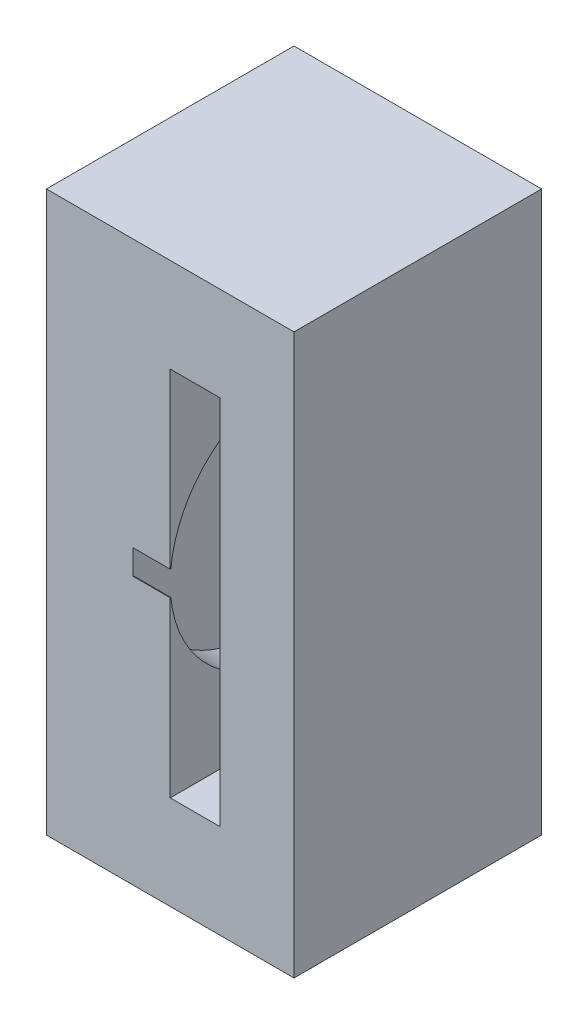
ISO-10303-21;
HEADER;
FILE_DESCRIPTION(('STEP AP214'),'2;1');
FILE_NAME('part.step','',(''),(''),'','','');
FILE_SCHEMA(('AUTOMOTIVE_DESIGN { 1 0 10303 214 1 1 1 1 }'));
ENDSEC;
DATA;
#1=APPLICATION_CONTEXT('core data for automotive mechanical design processes');
#2=APPLICATION_PROTOCOL_DEFINITION('international standard','automotive_design',2000,#1);
#3=PRODUCT_CONTEXT('',#1,'mechanical');
#4=PRODUCT('Part','Part','',(#3));
#5=PRODUCT_RELATED_PRODUCT_CATEGORY('part','',(#4));
#6=PRODUCT_DEFINITION_FORMATION('','',#4);
#7=PRODUCT_DEFINITION_CONTEXT('part definition',#1,'design');
#8=PRODUCT_DEFINITION('design','',#6,#7);
#9=PRODUCT_DEFINITION_SHAPE('','',#8);
#10=(LENGTH_UNIT() NAMED_UNIT(*) SI_UNIT(.MILLI.,.METRE.));
#11=(NAMED_UNIT(*) PLANE_ANGLE_UNIT() SI_UNIT($,.RADIAN.));
#12=(NAMED_UNIT(*) SI_UNIT($,.STERADIAN.) SOLID_ANGLE_UNIT());
#13=UNCERTAINTY_MEASURE_WITH_UNIT(LENGTH_MEASURE(1.E-05),#10,'distance_accuracy_value','');
#14=(GEOMETRIC_REPRESENTATION_CONTEXT(3) GLOBAL_UNCERTAINTY_ASSIGNED_CONTEXT((#13)) GLOBAL_UNIT_ASSIGNED_CONTEXT((#10,
#11,#12)) REPRESENTATION_CONTEXT('',''));
#15=CARTESIAN_POINT('',(0.,0.,0.));
#16=DIRECTION('',(0.,0.,1.));
#17=DIRECTION('',(1.,0.,0.));
#18=AXIS2_PLACEMENT_3D('',#15,#16,#17);
#19=CARTESIAN_POINT('',(20.1,0.,50.));
#20=DIRECTION('',(1.,0.,0.));
#21=DIRECTION('',(0.,0.,-1.));
#22=AXIS2_PLACEMENT_3D('',#19,#20,#21);
#23=PLANE('',#22);
#24=CARTESIAN_POINT('',(20.1,113.,0.));
#25=DIRECTION('',(-1.,0.,0.));
#26=DIRECTION('',(0.,0.,1.));
#27=AXIS2_PLACEMENT_3D('',#24,#25,#26);
#28=CIRCLE('',#27,6.50000000000001);
#29=CARTESIAN_POINT('',(20.1,119.184658438426,-2.));
#30=VERTEX_POINT('',#29);
#31=CARTESIAN_POINT('',(20.1,106.815341561573,-1.99999999999999));
#32=VERTEX_POINT('',#31);
#33=EDGE_CURVE('E413',#30,#32,#28,.T.);
#34=ORIENTED_EDGE('',*,*,#33,.F.);
#35=DIRECTION('',(0.,1.,0.));
#36=VECTOR('',#35,1.);
#37=CARTESIAN_POINT('',(20.1,119.184658438426,-2.));
#38=LINE('',#37,#36);
#39=EDGE_CURVE('E271',#32,#30,#38,.T.);
#40=ORIENTED_EDGE('',*,*,#39,.F.);
#41=EDGE_LOOP('',(#34,#40));
#42=FACE_BOUND('',#41,.T.);
#43=DIRECTION('',(0.,-1.,0.));
#44=VECTOR('',#43,1.);
#45=CARTESIAN_POINT('',(20.1,0.,-50.));
#46=LINE('',#45,#44);
#47=CARTESIAN_POINT('',(20.1,188.,-50.));
#48=VERTEX_POINT('',#47);
#49=CARTESIAN_POINT('',(20.1,38.,-50.));
#50=VERTEX_POINT('',#49);
#51=EDGE_CURVE('E542',#48,#50,#46,.T.);
#52=ORIENTED_EDGE('',*,*,#51,.T.);
#53=DIRECTION('',(0.,0.,-1.));
#54=VECTOR('',#53,1.);
#55=CARTESIAN_POINT('',(20.1,38.,50.));
#56=LINE('',#55,#54);
#57=CARTESIAN_POINT('',(20.1,38.,50.));
#58=VERTEX_POINT('',#57);
#59=EDGE_CURVE('E559',#58,#50,#56,.T.);
#60=ORIENTED_EDGE('',*,*,#59,.F.);
#61=DIRECTION('',(0.,-1.,0.));
#62=VECTOR('',#61,1.);
#63=CARTESIAN_POINT('',(20.1,0.,50.));
#64=LINE('',#63,#62);
#65=CARTESIAN_POINT('',(20.1,188.,50.));
#66=VERTEX_POINT('',#65);
#67=EDGE_CURVE('E547',#66,#58,#64,.T.);
#68=ORIENTED_EDGE('',*,*,#67,.F.);
#69=DIRECTION('',(0.,0.,-1.));
#70=VECTOR('',#69,1.);
#71=CARTESIAN_POINT('',(20.1,188.,50.));
#72=LINE('',#71,#70);
#73=EDGE_CURVE('E550',#66,#48,#72,.T.);
#74=ORIENTED_EDGE('',*,*,#73,.T.);
#75=EDGE_LOOP('',(#52,#60,#68,#74));
#76=FACE_BOUND('',#75,.T.);
#77=CARTESIAN_POINT('',(20.1,113.,0.));
#78=DIRECTION('',(-1.,0.,0.));
#79=DIRECTION('',(0.,0.,1.));
#80=AXIS2_PLACEMENT_3D('',#77,#78,#79);
#81=CIRCLE('',#80,6.50000000000001);
#82=CARTESIAN_POINT('',(20.1,106.815341561573,2.));
#83=VERTEX_POINT('',#82);
#84=CARTESIAN_POINT('',(20.1,119.184658438426,2.));
#85=VERTEX_POINT('',#84);
#86=EDGE_CURVE('E409',#83,#85,#81,.T.);
#87=ORIENTED_EDGE('',*,*,#86,.F.);
#88=DIRECTION('',(0.,-1.,0.));
#89=VECTOR('',#88,1.);
#90=CARTESIAN_POINT('',(20.1,119.184658438426,2.));
#91=LINE('',#90,#89);
#92=EDGE_CURVE('E264',#85,#83,#91,.T.);
#93=ORIENTED_EDGE('',*,*,#92,.F.);
#94=EDGE_LOOP('',(#87,#93));
#95=FACE_BOUND('',#94,.T.);
#96=ADVANCED_FACE('F250',(#42,#76,#95),#23,.F.);
#97=CARTESIAN_POINT('',(-15.,0.,50.));
#98=DIRECTION('',(-1.,0.,0.));
#99=DIRECTION('',(0.,0.,1.));
#100=AXIS2_PLACEMENT_3D('',#97,#98,#99);
#101=PLANE('',#100);
#102=CARTESIAN_POINT('',(-15.,113.,0.));
#103=DIRECTION('',(1.,0.,0.));
#104=DIRECTION('',(0.,0.,-1.));
#105=AXIS2_PLACEMENT_3D('',#102,#103,#104);
#106=CIRCLE('',#105,6.25000000000001);
#107=CARTESIAN_POINT('',(-15.,118.921359641164,2.00000000000001));
#108=VERTEX_POINT('',#107);
#109=CARTESIAN_POINT('',(-15.,107.078640358837,2.00000000000001));
#110=VERTEX_POINT('',#109);
#111=EDGE_CURVE('E467',#108,#110,#106,.T.);
#112=ORIENTED_EDGE('',*,*,#111,.F.);
#113=DIRECTION('',(0.,-1.,0.));
#114=VECTOR('',#113,1.);
#115=CARTESIAN_POINT('',(-15.,118.921359641164,2.00000000000001));
#116=LINE('',#115,#114);
#117=EDGE_CURVE('E465',#108,#110,#116,.T.);
#118=ORIENTED_EDGE('',*,*,#117,.T.);
#119=EDGE_LOOP('',(#112,#118));
#120=FACE_BOUND('',#119,.T.);
#121=DIRECTION('',(0.,0.,-1.));
#122=VECTOR('',#121,1.);
#123=CARTESIAN_POINT('',(-15.,118.,0.));
#124=LINE('',#123,#122);
#125=CARTESIAN_POINT('',(-15.,118.,-49.749371855331));
#126=VERTEX_POINT('',#125);
#127=CARTESIAN_POINT('',(-15.,118.,-50.));
#128=VERTEX_POINT('',#127);
#129=EDGE_CURVE('E489',#126,#128,#124,.T.);
#130=ORIENTED_EDGE('',*,*,#129,.F.);
#131=CARTESIAN_POINT('',(-15.,113.,0.));
#132=DIRECTION('',(1.,0.,0.));
#133=DIRECTION('',(0.,0.,-1.));
#134=AXIS2_PLACEMENT_3D('',#131,#132,#133);
#135=CIRCLE('',#134,50.);
#136=CARTESIAN_POINT('',(-15.,118.,49.749371855331));
#137=VERTEX_POINT('',#136);
#138=EDGE_CURVE('E492',#126,#137,#135,.T.);
#139=ORIENTED_EDGE('',*,*,#138,.T.);
#140=CARTESIAN_POINT('',(-15.,118.,50.));
#141=VERTEX_POINT('',#140);
#142=EDGE_CURVE('E493',#141,#137,#124,.T.);
#143=ORIENTED_EDGE('',*,*,#142,.F.);
#144=DIRECTION('',(0.,1.,0.));
#145=VECTOR('',#144,1.);
#146=CARTESIAN_POINT('',(-15.,0.,50.));
#147=LINE('',#146,#145);
#148=CARTESIAN_POINT('',(-15.,108.,50.));
#149=VERTEX_POINT('',#148);
#150=EDGE_CURVE('E541',#149,#141,#147,.T.);
#151=ORIENTED_EDGE('',*,*,#150,.F.);
#152=DIRECTION('',(0.,0.,-1.));
#153=VECTOR('',#152,1.);
#154=CARTESIAN_POINT('',(-15.,108.,0.));
#155=LINE('',#154,#153);
#156=CARTESIAN_POINT('',(-15.,108.,49.749371855331));
#157=VERTEX_POINT('',#156);
#158=EDGE_CURVE('E526',#149,#157,#155,.T.);
#159=ORIENTED_EDGE('',*,*,#158,.T.);
#160=CARTESIAN_POINT('',(-15.,113.,0.));
#161=DIRECTION('',(1.,0.,0.));
#162=DIRECTION('',(0.,0.,-1.));
#163=AXIS2_PLACEMENT_3D('',#160,#161,#162);
#164=CIRCLE('',#163,50.);
#165=CARTESIAN_POINT('',(-15.,108.,-49.749371855331));
#166=VERTEX_POINT('',#165);
#167=EDGE_CURVE('E495',#157,#166,#164,.T.);
#168=ORIENTED_EDGE('',*,*,#167,.T.);
#169=CARTESIAN_POINT('',(-15.,108.,-50.));
#170=VERTEX_POINT('',#169);
#171=EDGE_CURVE('E513',#166,#170,#155,.T.);
#172=ORIENTED_EDGE('',*,*,#171,.T.);
#173=DIRECTION('',(0.,1.,0.));
#174=VECTOR('',#173,1.);
#175=CARTESIAN_POINT('',(-15.,0.,-50.));
#176=LINE('',#175,#174);
#177=EDGE_CURVE('E553',#170,#128,#176,.T.);
#178=ORIENTED_EDGE('',*,*,#177,.T.);
#179=EDGE_LOOP('',(#130,#139,#143,#151,#159,#168,#172,#178));
#180=FACE_BOUND('',#179,.T.);
#181=DIRECTION('',(0.,-1.,0.));
#182=VECTOR('',#181,1.);
#183=CARTESIAN_POINT('',(-15.,118.921359641164,-1.99999999999999));
#184=LINE('',#183,#182);
#185=CARTESIAN_POINT('',(-15.,118.921359641164,-1.99999999999999));
#186=VERTEX_POINT('',#185);
#187=CARTESIAN_POINT('',(-15.,107.078640358837,-1.99999999999999));
#188=VERTEX_POINT('',#187);
#189=EDGE_CURVE('E448',#186,#188,#184,.T.);
#190=ORIENTED_EDGE('',*,*,#189,.F.);
#191=CARTESIAN_POINT('',(-15.,113.,0.));
#192=DIRECTION('',(-1.,0.,0.));
#193=DIRECTION('',(0.,0.,1.));
#194=AXIS2_PLACEMENT_3D('',#191,#192,#193);
#195=CIRCLE('',#194,6.25000000000001);
#196=EDGE_CURVE('E451',#186,#188,#195,.T.);
#197=ORIENTED_EDGE('',*,*,#196,.T.);
#198=EDGE_LOOP('',(#190,#197));
#199=FACE_BOUND('',#198,.T.);
#200=ADVANCED_FACE('F615',(#120,#180,#199),#101,.F.);
#201=CARTESIAN_POINT('',(50.,226.,-50.));
#202=DIRECTION('',(-1.,0.,0.));
#203=DIRECTION('',(0.,0.,1.));
#204=AXIS2_PLACEMENT_3D('',#201,#202,#203);
#205=PLANE('',#204);
#206=DIRECTION('',(0.,0.,-1.));
#207=VECTOR('',#206,1.);
#208=CARTESIAN_POINT('',(50.,0.,-50.));
#209=LINE('',#208,#207);
#210=CARTESIAN_POINT('',(50.,0.,50.));
#211=VERTEX_POINT('',#210);
#212=CARTESIAN_POINT('',(50.,0.,-50.));
#213=VERTEX_POINT('',#212);
#214=EDGE_CURVE('E561',#211,#213,#209,.T.);
#215=ORIENTED_EDGE('',*,*,#214,.T.);
#216=DIRECTION('',(0.,-1.,0.));
#217=VECTOR('',#216,1.);
#218=CARTESIAN_POINT('',(50.,226.,-50.));
#219=LINE('',#218,#217);
#220=CARTESIAN_POINT('',(50.,226.,-50.));
#221=VERTEX_POINT('',#220);
#222=EDGE_CURVE('E12',#221,#213,#219,.T.);
#223=ORIENTED_EDGE('',*,*,#222,.F.);
#224=DIRECTION('',(0.,0.,-1.));
#225=VECTOR('',#224,1.);
#226=CARTESIAN_POINT('',(50.,226.,-50.));
#227=LINE('',#226,#225);
#228=CARTESIAN_POINT('',(50.,226.,50.));
#229=VERTEX_POINT('',#228);
#230=EDGE_CURVE('E564',#229,#221,#227,.T.);
#231=ORIENTED_EDGE('',*,*,#230,.F.);
#232=DIRECTION('',(0.,-1.,0.));
#233=VECTOR('',#232,1.);
#234=CARTESIAN_POINT('',(50.,226.,50.));
#235=LINE('',#234,#233);
#236=EDGE_CURVE('E574',#229,#211,#235,.T.);
#237=ORIENTED_EDGE('',*,*,#236,.T.);
#238=EDGE_LOOP('',(#215,#223,#231,#237));
#239=FACE_BOUND('',#238,.T.);
#240=ADVANCED_FACE('F252',(#239),#205,.F.);
#241=CARTESIAN_POINT('',(-50.,226.,-50.));
#242=DIRECTION('',(0.,0.,1.));
#243=DIRECTION('',(1.,0.,0.));
#244=AXIS2_PLACEMENT_3D('',#241,#242,#243);
#245=PLANE('',#244);
#246=DIRECTION('',(1.,0.,0.));
#247=VECTOR('',#246,1.);
#248=CARTESIAN_POINT('',(2.97324684657449E-13,188.,-50.));
#249=LINE('',#248,#247);
#250=CARTESIAN_POINT('',(0.,188.,-50.));
#251=VERTEX_POINT('',#250);
#252=EDGE_CURVE('E555',#251,#48,#249,.T.);
#253=ORIENTED_EDGE('',*,*,#252,.F.);
#254=DIRECTION('',(0.,1.,0.));
#255=VECTOR('',#254,1.);
#256=CARTESIAN_POINT('',(0.,0.,-50.));
#257=LINE('',#256,#255);
#258=CARTESIAN_POINT('',(0.,118.,-50.));
#259=VERTEX_POINT('',#258);
#260=EDGE_CURVE('E501',#259,#251,#257,.T.);
#261=ORIENTED_EDGE('',*,*,#260,.F.);
#262=DIRECTION('',(-1.,0.,0.));
#263=VECTOR('',#262,1.);
#264=CARTESIAN_POINT('',(0.,118.,-50.));
#265=LINE('',#264,#263);
#266=EDGE_CURVE('E479',#259,#128,#265,.T.);
#267=ORIENTED_EDGE('',*,*,#266,.T.);
#268=ORIENTED_EDGE('',*,*,#177,.F.);
#269=DIRECTION('',(-1.,0.,0.));
#270=VECTOR('',#269,1.);
#271=CARTESIAN_POINT('',(0.,108.,-50.));
#272=LINE('',#271,#270);
#273=CARTESIAN_POINT('',(0.,108.,-50.));
#274=VERTEX_POINT('',#273);
#275=EDGE_CURVE('E531',#274,#170,#272,.T.);
#276=ORIENTED_EDGE('',*,*,#275,.F.);
#277=DIRECTION('',(0.,1.,0.));
#278=VECTOR('',#277,1.);
#279=CARTESIAN_POINT('',(0.,0.,-50.));
#280=LINE('',#279,#278);
#281=CARTESIAN_POINT('',(0.,38.,-50.));
#282=VERTEX_POINT('',#281);
#283=EDGE_CURVE('E522',#282,#274,#280,.T.);
#284=ORIENTED_EDGE('',*,*,#283,.F.);
#285=DIRECTION('',(-1.,0.,0.));
#286=VECTOR('',#285,1.);
#287=CARTESIAN_POINT('',(0.,38.,-50.));
#288=LINE('',#287,#286);
#289=EDGE_CURVE('E537',#50,#282,#288,.T.);
#290=ORIENTED_EDGE('',*,*,#289,.F.);
#291=ORIENTED_EDGE('',*,*,#51,.F.);
#292=EDGE_LOOP('',(#253,#261,#267,#268,#276,#284,#290,#291));
#293=FACE_BOUND('',#292,.T.);
#294=DIRECTION('',(-1.,0.,0.));
#295=VECTOR('',#294,1.);
#296=CARTESIAN_POINT('',(-50.,0.,-50.));
#297=LINE('',#296,#295);
#298=CARTESIAN_POINT('',(-50.,0.,-50.));
#299=VERTEX_POINT('',#298);
#300=EDGE_CURVE('E577',#213,#299,#297,.T.);
#301=ORIENTED_EDGE('',*,*,#300,.T.);
#302=DIRECTION('',(0.,-1.,0.));
#303=VECTOR('',#302,1.);
#304=CARTESIAN_POINT('',(-50.,226.,-50.));
#305=LINE('',#304,#303);
#306=CARTESIAN_POINT('',(-50.,226.,-50.));
#307=VERTEX_POINT('',#306);
#308=EDGE_CURVE('E258',#307,#299,#305,.T.);
#309=ORIENTED_EDGE('',*,*,#308,.F.);
#310=DIRECTION('',(-1.,0.,0.));
#311=VECTOR('',#310,1.);
#312=CARTESIAN_POINT('',(-50.,226.,-50.));
#313=LINE('',#312,#311);
#314=EDGE_CURVE('E567',#221,#307,#313,.T.);
#315=ORIENTED_EDGE('',*,*,#314,.F.);
#316=ORIENTED_EDGE('',*,*,#222,.T.);
#317=EDGE_LOOP('',(#301,#309,#315,#316));
#318=FACE_BOUND('',#317,.T.);
#319=ADVANCED_FACE('F607',(#293,#318),#245,.F.);
#320=CARTESIAN_POINT('',(-50.,226.,-50.));
#321=DIRECTION('',(1.,0.,0.));
#322=DIRECTION('',(0.,0.,-1.));
#323=AXIS2_PLACEMENT_3D('',#320,#321,#322);
#324=PLANE('',#323);
#325=DIRECTION('',(0.,0.,1.));
#326=VECTOR('',#325,1.);
#327=CARTESIAN_POINT('',(-50.,0.,-50.));
#328=LINE('',#327,#326);
#329=CARTESIAN_POINT('',(-50.,0.,50.));
#330=VERTEX_POINT('',#329);
#331=EDGE_CURVE('E579',#299,#330,#328,.T.);
#332=ORIENTED_EDGE('',*,*,#331,.T.);
#333=DIRECTION('',(0.,-1.,0.));
#334=VECTOR('',#333,1.);
#335=CARTESIAN_POINT('',(-50.,226.,50.));
#336=LINE('',#335,#334);
#337=CARTESIAN_POINT('',(-50.,226.,50.));
#338=VERTEX_POINT('',#337);
#339=EDGE_CURVE('E584',#338,#330,#336,.T.);
#340=ORIENTED_EDGE('',*,*,#339,.F.);
#341=DIRECTION('',(0.,0.,1.));
#342=VECTOR('',#341,1.);
#343=CARTESIAN_POINT('',(-50.,226.,-50.));
#344=LINE('',#343,#342);
#345=EDGE_CURVE('E570',#307,#338,#344,.T.);
#346=ORIENTED_EDGE('',*,*,#345,.F.);
#347=ORIENTED_EDGE('',*,*,#308,.T.);
#348=EDGE_LOOP('',(#332,#340,#346,#347));
#349=FACE_BOUND('',#348,.T.);
#350=ADVANCED_FACE('F591',(#349),#324,.F.);
#351=CARTESIAN_POINT('',(-50.,226.,50.));
#352=DIRECTION('',(0.,0.,-1.));
#353=DIRECTION('',(-1.,0.,0.));
#354=AXIS2_PLACEMENT_3D('',#351,#352,#353);
#355=PLANE('',#354);
#356=DIRECTION('',(0.,1.,0.));
#357=VECTOR('',#356,1.);
#358=CARTESIAN_POINT('',(0.,0.,50.));
#359=LINE('',#358,#357);
#360=CARTESIAN_POINT('',(0.,118.,50.));
#361=VERTEX_POINT('',#360);
#362=CARTESIAN_POINT('',(0.,188.,50.));
#363=VERTEX_POINT('',#362);
#364=EDGE_CURVE('E496',#361,#363,#359,.T.);
#365=ORIENTED_EDGE('',*,*,#364,.T.);
#366=DIRECTION('',(1.,0.,0.));
#367=VECTOR('',#366,1.);
#368=CARTESIAN_POINT('',(2.97324684657449E-13,188.,50.));
#369=LINE('',#368,#367);
#370=EDGE_CURVE('E545',#363,#66,#369,.T.);
#371=ORIENTED_EDGE('',*,*,#370,.T.);
#372=ORIENTED_EDGE('',*,*,#67,.T.);
#373=DIRECTION('',(-1.,0.,0.));
#374=VECTOR('',#373,1.);
#375=CARTESIAN_POINT('',(0.,38.,50.));
#376=LINE('',#375,#374);
#377=CARTESIAN_POINT('',(0.,38.,50.));
#378=VERTEX_POINT('',#377);
#379=EDGE_CURVE('E538',#58,#378,#376,.T.);
#380=ORIENTED_EDGE('',*,*,#379,.T.);
#381=DIRECTION('',(0.,1.,0.));
#382=VECTOR('',#381,1.);
#383=CARTESIAN_POINT('',(0.,0.,50.));
#384=LINE('',#383,#382);
#385=CARTESIAN_POINT('',(0.,108.,50.));
#386=VERTEX_POINT('',#385);
#387=EDGE_CURVE('E516',#378,#386,#384,.T.);
#388=ORIENTED_EDGE('',*,*,#387,.T.);
#389=DIRECTION('',(-1.,0.,0.));
#390=VECTOR('',#389,1.);
#391=CARTESIAN_POINT('',(0.,108.,50.));
#392=LINE('',#391,#390);
#393=EDGE_CURVE('E533',#386,#149,#392,.T.);
#394=ORIENTED_EDGE('',*,*,#393,.T.);
#395=ORIENTED_EDGE('',*,*,#150,.T.);
#396=DIRECTION('',(-1.,0.,0.));
#397=VECTOR('',#396,1.);
#398=CARTESIAN_POINT('',(0.,118.,50.));
#399=LINE('',#398,#397);
#400=EDGE_CURVE('E482',#361,#141,#399,.T.);
#401=ORIENTED_EDGE('',*,*,#400,.F.);
#402=EDGE_LOOP('',(#365,#371,#372,#380,#388,#394,#395,#401));
#403=FACE_BOUND('',#402,.T.);
#404=DIRECTION('',(1.,0.,0.));
#405=VECTOR('',#404,1.);
#406=CARTESIAN_POINT('',(-50.,0.,50.));
#407=LINE('',#406,#405);
#408=EDGE_CURVE('E568',#330,#211,#407,.T.);
#409=ORIENTED_EDGE('',*,*,#408,.T.);
#410=ORIENTED_EDGE('',*,*,#236,.F.);
#411=DIRECTION('',(1.,0.,0.));
#412=VECTOR('',#411,1.);
#413=CARTESIAN_POINT('',(-50.,226.,50.));
#414=LINE('',#413,#412);
#415=EDGE_CURVE('E572',#338,#229,#414,.T.);
#416=ORIENTED_EDGE('',*,*,#415,.F.);
#417=ORIENTED_EDGE('',*,*,#339,.T.);
#418=EDGE_LOOP('',(#409,#410,#416,#417));
#419=FACE_BOUND('',#418,.T.);
#420=ADVANCED_FACE('F600',(#403,#419),#355,.F.);
#421=CARTESIAN_POINT('',(0.,226.,0.));
#422=DIRECTION('',(0.,1.,0.));
#423=DIRECTION('',(0.,0.,1.));
#424=AXIS2_PLACEMENT_3D('',#421,#422,#423);
#425=PLANE('',#424);
#426=ORIENTED_EDGE('',*,*,#230,.T.);
#427=ORIENTED_EDGE('',*,*,#314,.T.);
#428=ORIENTED_EDGE('',*,*,#345,.T.);
#429=ORIENTED_EDGE('',*,*,#415,.T.);
#430=EDGE_LOOP('',(#426,#427,#428,#429));
#431=FACE_BOUND('',#430,.T.);
#432=ADVANCED_FACE('F606',(#431),#425,.T.);
#433=CARTESIAN_POINT('',(0.,0.,0.));
#434=DIRECTION('',(0.,1.,0.));
#435=DIRECTION('',(0.,0.,1.));
#436=AXIS2_PLACEMENT_3D('',#433,#434,#435);
#437=PLANE('',#436);
#438=ORIENTED_EDGE('',*,*,#214,.F.);
#439=ORIENTED_EDGE('',*,*,#408,.F.);
#440=ORIENTED_EDGE('',*,*,#331,.F.);
#441=ORIENTED_EDGE('',*,*,#300,.F.);
#442=EDGE_LOOP('',(#438,#439,#440,#441));
#443=FACE_BOUND('',#442,.T.);
#444=ADVANCED_FACE('F597',(#443),#437,.F.);
#445=CARTESIAN_POINT('',(0.,38.,50.));
#446=DIRECTION('',(0.,-1.,0.));
#447=DIRECTION('',(1.,0.,0.));
#448=AXIS2_PLACEMENT_3D('',#445,#446,#447);
#449=PLANE('',#448);
#450=ORIENTED_EDGE('',*,*,#289,.T.);
#451=DIRECTION('',(0.,0.,-1.));
#452=VECTOR('',#451,1.);
#453=CARTESIAN_POINT('',(0.,38.,0.));
#454=LINE('',#453,#452);
#455=EDGE_CURVE('E520',#378,#282,#454,.T.);
#456=ORIENTED_EDGE('',*,*,#455,.F.);
#457=ORIENTED_EDGE('',*,*,#379,.F.);
#458=ORIENTED_EDGE('',*,*,#59,.T.);
#459=EDGE_LOOP('',(#450,#456,#457,#458));
#460=FACE_BOUND('',#459,.T.);
#461=ADVANCED_FACE('F631',(#460),#449,.F.);
#462=CARTESIAN_POINT('',(2.97324684657449E-13,188.,50.));
#463=DIRECTION('',(0.,1.,0.));
#464=DIRECTION('',(-1.,0.,0.));
#465=AXIS2_PLACEMENT_3D('',#462,#463,#464);
#466=PLANE('',#465);
#467=ORIENTED_EDGE('',*,*,#370,.F.);
#468=DIRECTION('',(0.,0.,-1.));
#469=VECTOR('',#468,1.);
#470=CARTESIAN_POINT('',(0.,188.,0.));
#471=LINE('',#470,#469);
#472=EDGE_CURVE('E499',#363,#251,#471,.T.);
#473=ORIENTED_EDGE('',*,*,#472,.T.);
#474=ORIENTED_EDGE('',*,*,#252,.T.);
#475=ORIENTED_EDGE('',*,*,#73,.F.);
#476=EDGE_LOOP('',(#467,#473,#474,#475));
#477=FACE_BOUND('',#476,.T.);
#478=ADVANCED_FACE('F629',(#477),#466,.F.);
#479=CARTESIAN_POINT('',(0.,113.,0.));
#480=DIRECTION('',(-1.,0.,0.));
#481=DIRECTION('',(0.,0.,1.));
#482=AXIS2_PLACEMENT_3D('',#479,#480,#481);
#483=CYLINDRICAL_SURFACE('',#482,50.);
#484=ORIENTED_EDGE('',*,*,#167,.F.);
#485=DIRECTION('',(-1.,0.,0.));
#486=VECTOR('',#485,1.);
#487=CARTESIAN_POINT('',(0.,108.,49.749371855331));
#488=LINE('',#487,#486);
#489=CARTESIAN_POINT('',(0.,108.,49.749371855331));
#490=VERTEX_POINT('',#489);
#491=EDGE_CURVE('E535',#490,#157,#488,.T.);
#492=ORIENTED_EDGE('',*,*,#491,.F.);
#493=CARTESIAN_POINT('',(0.,113.,0.));
#494=DIRECTION('',(1.,0.,0.));
#495=DIRECTION('',(0.,0.,-1.));
#496=AXIS2_PLACEMENT_3D('',#493,#494,#495);
#497=CIRCLE('',#496,50.);
#498=CARTESIAN_POINT('',(0.,108.,-49.749371855331));
#499=VERTEX_POINT('',#498);
#500=EDGE_CURVE('E509',#490,#499,#497,.T.);
#501=ORIENTED_EDGE('',*,*,#500,.T.);
#502=DIRECTION('',(-1.,0.,0.));
#503=VECTOR('',#502,1.);
#504=CARTESIAN_POINT('',(0.,108.,-49.749371855331));
#505=LINE('',#504,#503);
#506=EDGE_CURVE('E529',#499,#166,#505,.T.);
#507=ORIENTED_EDGE('',*,*,#506,.T.);
#508=EDGE_LOOP('',(#484,#492,#501,#507));
#509=FACE_BOUND('',#508,.T.);
#510=ADVANCED_FACE('F627',(#509),#483,.F.);
#511=CARTESIAN_POINT('',(0.,108.,0.));
#512=DIRECTION('',(0.,1.,0.));
#513=DIRECTION('',(0.,0.,1.));
#514=AXIS2_PLACEMENT_3D('',#511,#512,#513);
#515=PLANE('',#514);
#516=ORIENTED_EDGE('',*,*,#158,.F.);
#517=ORIENTED_EDGE('',*,*,#393,.F.);
#518=DIRECTION('',(0.,0.,-1.));
#519=VECTOR('',#518,1.);
#520=CARTESIAN_POINT('',(0.,108.,0.));
#521=LINE('',#520,#519);
#522=EDGE_CURVE('E512',#386,#490,#521,.T.);
#523=ORIENTED_EDGE('',*,*,#522,.T.);
#524=ORIENTED_EDGE('',*,*,#491,.T.);
#525=EDGE_LOOP('',(#516,#517,#523,#524));
#526=FACE_BOUND('',#525,.T.);
#527=ADVANCED_FACE('F675',(#526),#515,.T.);
#528=ORIENTED_EDGE('',*,*,#171,.F.);
#529=ORIENTED_EDGE('',*,*,#506,.F.);
#530=EDGE_CURVE('E517',#499,#274,#521,.T.);
#531=ORIENTED_EDGE('',*,*,#530,.T.);
#532=ORIENTED_EDGE('',*,*,#275,.T.);
#533=EDGE_LOOP('',(#528,#529,#531,#532));
#534=FACE_BOUND('',#533,.T.);
#535=ADVANCED_FACE('F671',(#534),#515,.T.);
#536=CARTESIAN_POINT('',(0.,0.,0.));
#537=DIRECTION('',(1.,0.,0.));
#538=DIRECTION('',(0.,0.,-1.));
#539=AXIS2_PLACEMENT_3D('',#536,#537,#538);
#540=PLANE('',#539);
#541=ORIENTED_EDGE('',*,*,#500,.F.);
#542=ORIENTED_EDGE('',*,*,#522,.F.);
#543=ORIENTED_EDGE('',*,*,#387,.F.);
#544=ORIENTED_EDGE('',*,*,#455,.T.);
#545=ORIENTED_EDGE('',*,*,#283,.T.);
#546=ORIENTED_EDGE('',*,*,#530,.F.);
#547=EDGE_LOOP('',(#541,#542,#543,#544,#545,#546));
#548=FACE_BOUND('',#547,.T.);
#549=ADVANCED_FACE('F662',(#548),#540,.T.);
#550=CARTESIAN_POINT('',(0.,113.,0.));
#551=DIRECTION('',(-1.,0.,0.));
#552=DIRECTION('',(0.,0.,1.));
#553=AXIS2_PLACEMENT_3D('',#550,#551,#552);
#554=CYLINDRICAL_SURFACE('',#553,50.);
#555=ORIENTED_EDGE('',*,*,#138,.F.);
#556=DIRECTION('',(-1.,0.,0.));
#557=VECTOR('',#556,1.);
#558=CARTESIAN_POINT('',(0.,118.,-49.749371855331));
#559=LINE('',#558,#557);
#560=CARTESIAN_POINT('',(0.,118.,-49.749371855331));
#561=VERTEX_POINT('',#560);
#562=EDGE_CURVE('E471',#561,#126,#559,.T.);
#563=ORIENTED_EDGE('',*,*,#562,.F.);
#564=CARTESIAN_POINT('',(0.,113.,0.));
#565=DIRECTION('',(1.,0.,0.));
#566=DIRECTION('',(0.,0.,-1.));
#567=AXIS2_PLACEMENT_3D('',#564,#565,#566);
#568=CIRCLE('',#567,50.);
#569=CARTESIAN_POINT('',(0.,118.,49.749371855331));
#570=VERTEX_POINT('',#569);
#571=EDGE_CURVE('E506',#561,#570,#568,.T.);
#572=ORIENTED_EDGE('',*,*,#571,.T.);
#573=DIRECTION('',(-1.,0.,0.));
#574=VECTOR('',#573,1.);
#575=CARTESIAN_POINT('',(0.,118.,49.749371855331));
#576=LINE('',#575,#574);
#577=EDGE_CURVE('E485',#570,#137,#576,.T.);
#578=ORIENTED_EDGE('',*,*,#577,.T.);
#579=EDGE_LOOP('',(#555,#563,#572,#578));
#580=FACE_BOUND('',#579,.T.);
#581=ADVANCED_FACE('F684',(#580),#554,.F.);
#582=CARTESIAN_POINT('',(0.,118.,0.));
#583=DIRECTION('',(0.,1.,0.));
#584=DIRECTION('',(0.,0.,1.));
#585=AXIS2_PLACEMENT_3D('',#582,#583,#584);
#586=PLANE('',#585);
#587=ORIENTED_EDGE('',*,*,#129,.T.);
#588=ORIENTED_EDGE('',*,*,#266,.F.);
#589=DIRECTION('',(0.,0.,-1.));
#590=VECTOR('',#589,1.);
#591=CARTESIAN_POINT('',(0.,118.,0.));
#592=LINE('',#591,#590);
#593=EDGE_CURVE('E504',#561,#259,#592,.T.);
#594=ORIENTED_EDGE('',*,*,#593,.F.);
#595=ORIENTED_EDGE('',*,*,#562,.T.);
#596=EDGE_LOOP('',(#587,#588,#594,#595));
#597=FACE_BOUND('',#596,.T.);
#598=ADVANCED_FACE('F688',(#597),#586,.F.);
#599=ORIENTED_EDGE('',*,*,#142,.T.);
#600=ORIENTED_EDGE('',*,*,#577,.F.);
#601=EDGE_CURVE('E488',#361,#570,#592,.T.);
#602=ORIENTED_EDGE('',*,*,#601,.F.);
#603=ORIENTED_EDGE('',*,*,#400,.T.);
#604=EDGE_LOOP('',(#599,#600,#602,#603));
#605=FACE_BOUND('',#604,.T.);
#606=ADVANCED_FACE('F681',(#605),#586,.F.);
#607=CARTESIAN_POINT('',(0.,0.,0.));
#608=DIRECTION('',(1.,0.,0.));
#609=DIRECTION('',(0.,0.,-1.));
#610=AXIS2_PLACEMENT_3D('',#607,#608,#609);
#611=PLANE('',#610);
#612=ORIENTED_EDGE('',*,*,#571,.F.);
#613=ORIENTED_EDGE('',*,*,#593,.T.);
#614=ORIENTED_EDGE('',*,*,#260,.T.);
#615=ORIENTED_EDGE('',*,*,#472,.F.);
#616=ORIENTED_EDGE('',*,*,#364,.F.);
#617=ORIENTED_EDGE('',*,*,#601,.T.);
#618=EDGE_LOOP('',(#612,#613,#614,#615,#616,#617));
#619=FACE_BOUND('',#618,.T.);
#620=ADVANCED_FACE('F651',(#619),#611,.T.);
#621=CARTESIAN_POINT('',(0.,0.,2.00000000000001));
#622=DIRECTION('',(0.,0.,-1.));
#623=DIRECTION('',(-1.,0.,0.));
#624=AXIS2_PLACEMENT_3D('',#621,#622,#623);
#625=PLANE('',#624);
#626=DIRECTION('',(-1.,0.,0.));
#627=VECTOR('',#626,1.);
#628=CARTESIAN_POINT('',(0.,107.078640358837,2.00000000000001));
#629=LINE('',#628,#627);
#630=CARTESIAN_POINT('',(0.,107.078640358837,2.00000000000001));
#631=VERTEX_POINT('',#630);
#632=EDGE_CURVE('E455',#631,#110,#629,.T.);
#633=ORIENTED_EDGE('',*,*,#632,.T.);
#634=ORIENTED_EDGE('',*,*,#117,.F.);
#635=DIRECTION('',(-1.,0.,0.));
#636=VECTOR('',#635,1.);
#637=CARTESIAN_POINT('',(0.,118.921359641164,2.00000000000001));
#638=LINE('',#637,#636);
#639=CARTESIAN_POINT('',(0.,118.921359641164,2.00000000000001));
#640=VERTEX_POINT('',#639);
#641=EDGE_CURVE('E461',#640,#108,#638,.T.);
#642=ORIENTED_EDGE('',*,*,#641,.F.);
#643=DIRECTION('',(0.,-1.,0.));
#644=VECTOR('',#643,1.);
#645=CARTESIAN_POINT('',(0.,118.921359641164,2.00000000000001));
#646=LINE('',#645,#644);
#647=EDGE_CURVE('E464',#640,#631,#646,.T.);
#648=ORIENTED_EDGE('',*,*,#647,.T.);
#649=EDGE_LOOP('',(#633,#634,#642,#648));
#650=FACE_BOUND('',#649,.T.);
#651=ADVANCED_FACE('F702',(#650),#625,.T.);
#652=CARTESIAN_POINT('',(0.,113.,0.));
#653=DIRECTION('',(-1.,0.,0.));
#654=DIRECTION('',(0.,0.,1.));
#655=AXIS2_PLACEMENT_3D('',#652,#653,#654);
#656=CYLINDRICAL_SURFACE('',#655,6.25000000000001);
#657=ORIENTED_EDGE('',*,*,#111,.T.);
#658=ORIENTED_EDGE('',*,*,#632,.F.);
#659=CARTESIAN_POINT('',(0.,113.,0.));
#660=DIRECTION('',(1.,0.,0.));
#661=DIRECTION('',(0.,0.,-1.));
#662=AXIS2_PLACEMENT_3D('',#659,#660,#661);
#663=CIRCLE('',#662,6.25000000000001);
#664=EDGE_CURVE('E468',#640,#631,#663,.T.);
#665=ORIENTED_EDGE('',*,*,#664,.F.);
#666=ORIENTED_EDGE('',*,*,#641,.T.);
#667=EDGE_LOOP('',(#657,#658,#665,#666));
#668=FACE_BOUND('',#667,.T.);
#669=ADVANCED_FACE('F711',(#668),#656,.T.);
#670=CARTESIAN_POINT('',(0.,0.,0.));
#671=DIRECTION('',(1.,0.,0.));
#672=DIRECTION('',(0.,0.,-1.));
#673=AXIS2_PLACEMENT_3D('',#670,#671,#672);
#674=PLANE('',#673);
#675=ORIENTED_EDGE('',*,*,#664,.T.);
#676=ORIENTED_EDGE('',*,*,#647,.F.);
#677=EDGE_LOOP('',(#675,#676));
#678=FACE_BOUND('',#677,.T.);
#679=ADVANCED_FACE('F707',(#678),#674,.T.);
#680=CARTESIAN_POINT('',(0.,0.,-2.00000000000002));
#681=DIRECTION('',(0.,0.,-1.));
#682=DIRECTION('',(0.,1.,0.));
#683=AXIS2_PLACEMENT_3D('',#680,#681,#682);
#684=PLANE('',#683);
#685=DIRECTION('',(-1.,0.,0.));
#686=VECTOR('',#685,1.);
#687=CARTESIAN_POINT('',(0.,118.921359641164,-1.99999999999999));
#688=LINE('',#687,#686);
#689=CARTESIAN_POINT('',(0.,118.921359641164,-1.99999999999999));
#690=VERTEX_POINT('',#689);
#691=EDGE_CURVE('E444',#690,#186,#688,.T.);
#692=ORIENTED_EDGE('',*,*,#691,.T.);
#693=ORIENTED_EDGE('',*,*,#189,.T.);
#694=DIRECTION('',(-1.,0.,0.));
#695=VECTOR('',#694,1.);
#696=CARTESIAN_POINT('',(0.,107.078640358837,-1.99999999999999));
#697=LINE('',#696,#695);
#698=CARTESIAN_POINT('',(0.,107.078640358837,-1.99999999999999));
#699=VERTEX_POINT('',#698);
#700=EDGE_CURVE('E445',#699,#188,#697,.T.);
#701=ORIENTED_EDGE('',*,*,#700,.F.);
#702=DIRECTION('',(0.,-1.,0.));
#703=VECTOR('',#702,1.);
#704=CARTESIAN_POINT('',(0.,118.921359641164,-1.99999999999999));
#705=LINE('',#704,#703);
#706=EDGE_CURVE('E447',#690,#699,#705,.T.);
#707=ORIENTED_EDGE('',*,*,#706,.F.);
#708=EDGE_LOOP('',(#692,#693,#701,#707));
#709=FACE_BOUND('',#708,.T.);
#710=ADVANCED_FACE('F710',(#709),#684,.F.);
#711=CARTESIAN_POINT('',(0.,113.,0.));
#712=DIRECTION('',(-1.,0.,0.));
#713=DIRECTION('',(0.,0.,1.));
#714=AXIS2_PLACEMENT_3D('',#711,#712,#713);
#715=CYLINDRICAL_SURFACE('',#714,6.25000000000001);
#716=ORIENTED_EDGE('',*,*,#196,.F.);
#717=ORIENTED_EDGE('',*,*,#691,.F.);
#718=CARTESIAN_POINT('',(0.,113.,0.));
#719=DIRECTION('',(-1.,0.,0.));
#720=DIRECTION('',(0.,0.,1.));
#721=AXIS2_PLACEMENT_3D('',#718,#719,#720);
#722=CIRCLE('',#721,6.25000000000001);
#723=EDGE_CURVE('E452',#690,#699,#722,.T.);
#724=ORIENTED_EDGE('',*,*,#723,.T.);
#725=ORIENTED_EDGE('',*,*,#700,.T.);
#726=EDGE_LOOP('',(#716,#717,#724,#725));
#727=FACE_BOUND('',#726,.T.);
#728=ADVANCED_FACE('F723',(#727),#715,.T.);
#729=CARTESIAN_POINT('',(0.,0.,0.));
#730=DIRECTION('',(1.,0.,0.));
#731=DIRECTION('',(0.,0.,-1.));
#732=AXIS2_PLACEMENT_3D('',#729,#730,#731);
#733=PLANE('',#732);
#734=ORIENTED_EDGE('',*,*,#723,.F.);
#735=ORIENTED_EDGE('',*,*,#706,.T.);
#736=EDGE_LOOP('',(#734,#735));
#737=FACE_BOUND('',#736,.T.);
#738=ADVANCED_FACE('F719',(#737),#733,.T.);
#739=CARTESIAN_POINT('',(1.09999999999998,113.,0.));
#740=DIRECTION('',(1.,0.,0.));
#741=DIRECTION('',(0.,0.,-1.));
#742=AXIS2_PLACEMENT_3D('',#739,#740,#741);
#743=CYLINDRICAL_SURFACE('',#742,6.50000000000001);
#744=ORIENTED_EDGE('',*,*,#33,.T.);
#745=DIRECTION('',(1.,0.,0.));
#746=VECTOR('',#745,1.);
#747=CARTESIAN_POINT('',(1.09999999999998,106.815341561573,-2.));
#748=LINE('',#747,#746);
#749=CARTESIAN_POINT('',(1.09999999999998,106.815341561573,-2.));
#750=VERTEX_POINT('',#749);
#751=EDGE_CURVE('E442',#750,#32,#748,.T.);
#752=ORIENTED_EDGE('',*,*,#751,.F.);
#753=CARTESIAN_POINT('',(1.09999999999998,113.,0.));
#754=DIRECTION('',(-1.,0.,0.));
#755=DIRECTION('',(0.,0.,1.));
#756=AXIS2_PLACEMENT_3D('',#753,#754,#755);
#757=CIRCLE('',#756,6.50000000000001);
#758=CARTESIAN_POINT('',(1.09999999999998,119.184658438426,-2.));
#759=VERTEX_POINT('',#758);
#760=EDGE_CURVE('E431',#759,#750,#757,.T.);
#761=ORIENTED_EDGE('',*,*,#760,.F.);
#762=DIRECTION('',(1.,0.,0.));
#763=VECTOR('',#762,1.);
#764=CARTESIAN_POINT('',(1.09999999999998,119.184658438426,-2.));
#765=LINE('',#764,#763);
#766=EDGE_CURVE('E436',#759,#30,#765,.T.);
#767=ORIENTED_EDGE('',*,*,#766,.T.);
#768=EDGE_LOOP('',(#744,#752,#761,#767));
#769=FACE_BOUND('',#768,.T.);
#770=ADVANCED_FACE('F722',(#769),#743,.T.);
#771=CARTESIAN_POINT('',(1.09999999999998,119.184658438426,-2.));
#772=DIRECTION('',(0.,0.,-1.));
#773=DIRECTION('',(-1.,0.,0.));
#774=AXIS2_PLACEMENT_3D('',#771,#772,#773);
#775=PLANE('',#774);
#776=ORIENTED_EDGE('',*,*,#39,.T.);
#777=ORIENTED_EDGE('',*,*,#766,.F.);
#778=DIRECTION('',(0.,1.,0.));
#779=VECTOR('',#778,1.);
#780=CARTESIAN_POINT('',(1.09999999999998,119.184658438426,-2.));
#781=LINE('',#780,#779);
#782=EDGE_CURVE('E434',#750,#759,#781,.T.);
#783=ORIENTED_EDGE('',*,*,#782,.F.);
#784=ORIENTED_EDGE('',*,*,#751,.T.);
#785=EDGE_LOOP('',(#776,#777,#783,#784));
#786=FACE_BOUND('',#785,.T.);
#787=ADVANCED_FACE('F733',(#786),#775,.F.);
#788=CARTESIAN_POINT('',(1.09999999999998,113.,0.));
#789=DIRECTION('',(-1.,0.,0.));
#790=DIRECTION('',(0.,0.,1.));
#791=AXIS2_PLACEMENT_3D('',#788,#789,#790);
#792=PLANE('',#791);
#793=ORIENTED_EDGE('',*,*,#760,.T.);
#794=ORIENTED_EDGE('',*,*,#782,.T.);
#795=EDGE_LOOP('',(#793,#794));
#796=FACE_BOUND('',#795,.T.);
#797=ADVANCED_FACE('F737',(#796),#792,.T.);
#798=CARTESIAN_POINT('',(1.09999999999998,113.,0.));
#799=DIRECTION('',(1.,0.,0.));
#800=DIRECTION('',(0.,0.,-1.));
#801=AXIS2_PLACEMENT_3D('',#798,#799,#800);
#802=CYLINDRICAL_SURFACE('',#801,6.50000000000001);
#803=ORIENTED_EDGE('',*,*,#86,.T.);
#804=DIRECTION('',(1.,0.,0.));
#805=VECTOR('',#804,1.);
#806=CARTESIAN_POINT('',(1.09999999999998,119.184658438426,2.));
#807=LINE('',#806,#805);
#808=CARTESIAN_POINT('',(1.09999999999998,119.184658438426,2.));
#809=VERTEX_POINT('',#808);
#810=EDGE_CURVE('E420',#809,#85,#807,.T.);
#811=ORIENTED_EDGE('',*,*,#810,.F.);
#812=CARTESIAN_POINT('',(1.09999999999998,113.,0.));
#813=DIRECTION('',(-1.,0.,0.));
#814=DIRECTION('',(0.,0.,1.));
#815=AXIS2_PLACEMENT_3D('',#812,#813,#814);
#816=CIRCLE('',#815,6.50000000000001);
#817=CARTESIAN_POINT('',(1.09999999999998,106.815341561573,2.));
#818=VERTEX_POINT('',#817);
#819=EDGE_CURVE('E421',#818,#809,#816,.T.);
#820=ORIENTED_EDGE('',*,*,#819,.F.);
#821=DIRECTION('',(1.,0.,0.));
#822=VECTOR('',#821,1.);
#823=CARTESIAN_POINT('',(1.09999999999998,106.815341561573,2.));
#824=LINE('',#823,#822);
#825=EDGE_CURVE('E418',#818,#83,#824,.T.);
#826=ORIENTED_EDGE('',*,*,#825,.T.);
#827=EDGE_LOOP('',(#803,#811,#820,#826));
#828=FACE_BOUND('',#827,.T.);
#829=ADVANCED_FACE('F423',(#828),#802,.T.);
#830=CARTESIAN_POINT('',(1.09999999999998,119.184658438426,2.));
#831=DIRECTION('',(0.,0.,1.));
#832=DIRECTION('',(1.,0.,0.));
#833=AXIS2_PLACEMENT_3D('',#830,#831,#832);
#834=PLANE('',#833);
#835=ORIENTED_EDGE('',*,*,#92,.T.);
#836=ORIENTED_EDGE('',*,*,#825,.F.);
#837=DIRECTION('',(0.,-1.,0.));
#838=VECTOR('',#837,1.);
#839=CARTESIAN_POINT('',(1.09999999999998,119.184658438426,2.));
#840=LINE('',#839,#838);
#841=EDGE_CURVE('E425',#809,#818,#840,.T.);
#842=ORIENTED_EDGE('',*,*,#841,.F.);
#843=ORIENTED_EDGE('',*,*,#810,.T.);
#844=EDGE_LOOP('',(#835,#836,#842,#843));
#845=FACE_BOUND('',#844,.T.);
#846=ADVANCED_FACE('F417',(#845),#834,.F.);
#847=CARTESIAN_POINT('',(1.09999999999998,113.,0.));
#848=DIRECTION('',(-1.,0.,0.));
#849=DIRECTION('',(0.,0.,1.));
#850=AXIS2_PLACEMENT_3D('',#847,#848,#849);
#851=PLANE('',#850);
#852=ORIENTED_EDGE('',*,*,#819,.T.);
#853=ORIENTED_EDGE('',*,*,#841,.T.);
#854=EDGE_LOOP('',(#852,#853));
#855=FACE_BOUND('',#854,.T.);
#856=ADVANCED_FACE('F742',(#855),#851,.T.);
#857=CLOSED_SHELL('',(#96,#200,#240,#319,#350,#420,#432,#444,#461,#478,#510,#527,#535,#549,#581,
#598,#606,#620,#651,#669,#679,#710,#728,#738,#770,#787,#797,#829,#846,#856));
#858=MANIFOLD_SOLID_BREP('B2',#857);
#859=ADVANCED_BREP_SHAPE_REPRESENTATION('',(#18,#858),#14);
#860=SHAPE_DEFINITION_REPRESENTATION(#9,#859);
ENDSEC;
END-ISO-10303-21;
